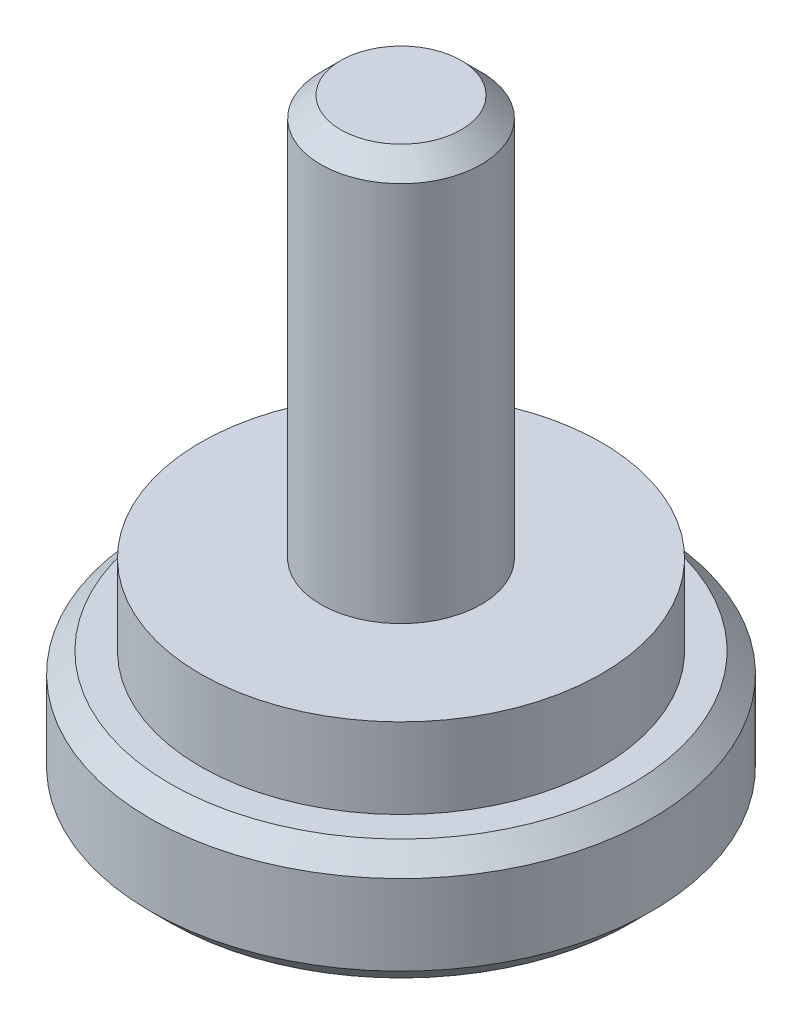
ISO-10303-21;
HEADER;
FILE_DESCRIPTION(('STEP AP214'),'2;1');
FILE_NAME('part.step','',(''),(''),'','','');
FILE_SCHEMA(('AUTOMOTIVE_DESIGN { 1 0 10303 214 1 1 1 1 }'));
ENDSEC;
DATA;
#1=APPLICATION_CONTEXT('core data for automotive mechanical design processes');
#2=APPLICATION_PROTOCOL_DEFINITION('international standard','automotive_design',2000,#1);
#3=PRODUCT_CONTEXT('',#1,'mechanical');
#4=PRODUCT('Part','Part','',(#3));
#5=PRODUCT_RELATED_PRODUCT_CATEGORY('part','',(#4));
#6=PRODUCT_DEFINITION_FORMATION('','',#4);
#7=PRODUCT_DEFINITION_CONTEXT('part definition',#1,'design');
#8=PRODUCT_DEFINITION('design','',#6,#7);
#9=PRODUCT_DEFINITION_SHAPE('','',#8);
#10=(LENGTH_UNIT() NAMED_UNIT(*) SI_UNIT(.MILLI.,.METRE.));
#11=(NAMED_UNIT(*) PLANE_ANGLE_UNIT() SI_UNIT($,.RADIAN.));
#12=(NAMED_UNIT(*) SI_UNIT($,.STERADIAN.) SOLID_ANGLE_UNIT());
#13=UNCERTAINTY_MEASURE_WITH_UNIT(LENGTH_MEASURE(1.E-05),#10,'distance_accuracy_value','');
#14=(GEOMETRIC_REPRESENTATION_CONTEXT(3) GLOBAL_UNCERTAINTY_ASSIGNED_CONTEXT((#13)) GLOBAL_UNIT_ASSIGNED_CONTEXT((#10,
#11,#12)) REPRESENTATION_CONTEXT('',''));
#15=CARTESIAN_POINT('',(0.,0.,0.));
#16=DIRECTION('',(0.,0.,1.));
#17=DIRECTION('',(1.,0.,0.));
#18=AXIS2_PLACEMENT_3D('',#15,#16,#17);
#19=CARTESIAN_POINT('',(0.,5.,0.));
#20=DIRECTION('',(0.,1.,0.));
#21=DIRECTION('',(0.,0.,1.));
#22=AXIS2_PLACEMENT_3D('',#19,#20,#21);
#23=PLANE('',#22);
#24=CARTESIAN_POINT('',(0.,5.,0.));
#25=DIRECTION('',(0.,1.,0.));
#26=DIRECTION('',(0.,0.,1.));
#27=AXIS2_PLACEMENT_3D('',#24,#25,#26);
#28=CIRCLE('',#27,5.);
#29=CARTESIAN_POINT('',(0.,5.,5.));
#30=VERTEX_POINT('',#29);
#31=EDGE_CURVE('E142',#30,#30,#28,.T.);
#32=ORIENTED_EDGE('',*,*,#31,.T.);
#33=EDGE_LOOP('',(#32));
#34=FACE_BOUND('',#33,.T.);
#35=CARTESIAN_POINT('',(0.,5.,0.));
#36=DIRECTION('',(0.,1.,0.));
#37=DIRECTION('',(0.,0.,1.));
#38=AXIS2_PLACEMENT_3D('',#35,#36,#37);
#39=CIRCLE('',#38,2.);
#40=CARTESIAN_POINT('',(0.,5.,2.));
#41=VERTEX_POINT('',#40);
#42=EDGE_CURVE('E133',#41,#41,#39,.T.);
#43=ORIENTED_EDGE('',*,*,#42,.F.);
#44=EDGE_LOOP('',(#43));
#45=FACE_BOUND('',#44,.T.);
#46=ADVANCED_FACE('F31',(#34,#45),#23,.T.);
#47=CARTESIAN_POINT('',(0.,3.,0.));
#48=DIRECTION('',(0.,1.,0.));
#49=DIRECTION('',(0.,0.,1.));
#50=AXIS2_PLACEMENT_3D('',#47,#48,#49);
#51=PLANE('',#50);
#52=CARTESIAN_POINT('',(0.,3.,0.));
#53=DIRECTION('',(0.,1.,0.));
#54=DIRECTION('',(0.,0.,1.));
#55=AXIS2_PLACEMENT_3D('',#52,#53,#54);
#56=CIRCLE('',#55,5.75);
#57=CARTESIAN_POINT('',(0.,3.,5.75));
#58=VERTEX_POINT('',#57);
#59=EDGE_CURVE('E145',#58,#58,#56,.T.);
#60=ORIENTED_EDGE('',*,*,#59,.T.);
#61=EDGE_LOOP('',(#60));
#62=FACE_BOUND('',#61,.T.);
#63=CARTESIAN_POINT('',(0.,3.,0.));
#64=DIRECTION('',(0.,1.,0.));
#65=DIRECTION('',(0.,0.,1.));
#66=AXIS2_PLACEMENT_3D('',#63,#64,#65);
#67=CIRCLE('',#66,5.);
#68=CARTESIAN_POINT('',(0.,3.,5.));
#69=VERTEX_POINT('',#68);
#70=EDGE_CURVE('E141',#69,#69,#67,.T.);
#71=ORIENTED_EDGE('',*,*,#70,.F.);
#72=EDGE_LOOP('',(#71));
#73=FACE_BOUND('',#72,.T.);
#74=ADVANCED_FACE('F177',(#62,#73),#51,.T.);
#75=CARTESIAN_POINT('',(0.,3.,0.));
#76=DIRECTION('',(0.,-1.,0.));
#77=DIRECTION('',(0.,0.,-1.));
#78=AXIS2_PLACEMENT_3D('',#75,#76,#77);
#79=CYLINDRICAL_SURFACE('',#78,6.25);
#80=CARTESIAN_POINT('',(0.,2.5,0.));
#81=DIRECTION('',(0.,1.,0.));
#82=DIRECTION('',(0.,0.,1.));
#83=AXIS2_PLACEMENT_3D('',#80,#81,#82);
#84=CIRCLE('',#83,6.25);
#85=CARTESIAN_POINT('',(0.,2.5,6.25));
#86=VERTEX_POINT('',#85);
#87=EDGE_CURVE('E153',#86,#86,#84,.F.);
#88=ORIENTED_EDGE('',*,*,#87,.T.);
#89=EDGE_LOOP('',(#88));
#90=FACE_BOUND('',#89,.T.);
#91=CARTESIAN_POINT('',(0.,0.499999999999997,0.));
#92=DIRECTION('',(0.,1.,0.));
#93=DIRECTION('',(0.,0.,1.));
#94=AXIS2_PLACEMENT_3D('',#91,#92,#93);
#95=CIRCLE('',#94,6.25);
#96=CARTESIAN_POINT('',(0.,0.499999999999997,6.25));
#97=VERTEX_POINT('',#96);
#98=EDGE_CURVE('E150',#97,#97,#95,.T.);
#99=ORIENTED_EDGE('',*,*,#98,.T.);
#100=EDGE_LOOP('',(#99));
#101=FACE_BOUND('',#100,.T.);
#102=ADVANCED_FACE('F183',(#90,#101),#79,.T.);
#103=CARTESIAN_POINT('',(0.,0.,0.));
#104=DIRECTION('',(0.,1.,0.));
#105=DIRECTION('',(0.,0.,1.));
#106=AXIS2_PLACEMENT_3D('',#103,#104,#105);
#107=PLANE('',#106);
#108=DIRECTION('',(-0.866025403784439,0.,-0.5));
#109=VECTOR('',#108,1.);
#110=CARTESIAN_POINT('',(0.,0.,2.3094010767585));
#111=LINE('',#110,#109);
#112=CARTESIAN_POINT('',(0.,0.,2.3094010767585));
#113=VERTEX_POINT('',#112);
#114=CARTESIAN_POINT('',(-2.,0.,1.15470053837925));
#115=VERTEX_POINT('',#114);
#116=EDGE_CURVE('E120',#113,#115,#111,.T.);
#117=ORIENTED_EDGE('',*,*,#116,.F.);
#118=DIRECTION('',(-0.866025403784439,0.,0.5));
#119=VECTOR('',#118,1.);
#120=CARTESIAN_POINT('',(2.,0.,1.15470053837925));
#121=LINE('',#120,#119);
#122=CARTESIAN_POINT('',(2.,0.,1.15470053837925));
#123=VERTEX_POINT('',#122);
#124=EDGE_CURVE('E46',#123,#113,#121,.T.);
#125=ORIENTED_EDGE('',*,*,#124,.F.);
#126=DIRECTION('',(0.,0.,1.));
#127=VECTOR('',#126,1.);
#128=CARTESIAN_POINT('',(2.,0.,-1.15470053837925));
#129=LINE('',#128,#127);
#130=CARTESIAN_POINT('',(2.,0.,-1.15470053837925));
#131=VERTEX_POINT('',#130);
#132=EDGE_CURVE('E129',#131,#123,#129,.T.);
#133=ORIENTED_EDGE('',*,*,#132,.F.);
#134=DIRECTION('',(0.866025403784439,0.,0.5));
#135=VECTOR('',#134,1.);
#136=CARTESIAN_POINT('',(0.,0.,-2.3094010767585));
#137=LINE('',#136,#135);
#138=CARTESIAN_POINT('',(0.,0.,-2.3094010767585));
#139=VERTEX_POINT('',#138);
#140=EDGE_CURVE('E127',#139,#131,#137,.T.);
#141=ORIENTED_EDGE('',*,*,#140,.F.);
#142=DIRECTION('',(0.866025403784439,0.,-0.5));
#143=VECTOR('',#142,1.);
#144=CARTESIAN_POINT('',(-2.,0.,-1.15470053837925));
#145=LINE('',#144,#143);
#146=CARTESIAN_POINT('',(-2.,0.,-1.15470053837925));
#147=VERTEX_POINT('',#146);
#148=EDGE_CURVE('E94',#147,#139,#145,.T.);
#149=ORIENTED_EDGE('',*,*,#148,.F.);
#150=DIRECTION('',(0.,0.,-1.));
#151=VECTOR('',#150,1.);
#152=CARTESIAN_POINT('',(-2.,0.,1.15470053837925));
#153=LINE('',#152,#151);
#154=EDGE_CURVE('E123',#115,#147,#153,.T.);
#155=ORIENTED_EDGE('',*,*,#154,.F.);
#156=EDGE_LOOP('',(#117,#125,#133,#141,#149,#155));
#157=FACE_BOUND('',#156,.T.);
#158=CARTESIAN_POINT('',(0.,0.,0.));
#159=DIRECTION('',(0.,1.,0.));
#160=DIRECTION('',(0.,0.,1.));
#161=AXIS2_PLACEMENT_3D('',#158,#159,#160);
#162=CIRCLE('',#161,5.75);
#163=CARTESIAN_POINT('',(0.,0.,5.75));
#164=VERTEX_POINT('',#163);
#165=EDGE_CURVE('E156',#164,#164,#162,.F.);
#166=ORIENTED_EDGE('',*,*,#165,.T.);
#167=EDGE_LOOP('',(#166));
#168=FACE_BOUND('',#167,.T.);
#169=ADVANCED_FACE('F193',(#157,#168),#107,.F.);
#170=CARTESIAN_POINT('',(0.,5.,0.));
#171=DIRECTION('',(0.,-1.,0.));
#172=DIRECTION('',(0.,0.,-1.));
#173=AXIS2_PLACEMENT_3D('',#170,#171,#172);
#174=CYLINDRICAL_SURFACE('',#173,5.);
#175=ORIENTED_EDGE('',*,*,#31,.F.);
#176=EDGE_LOOP('',(#175));
#177=FACE_BOUND('',#176,.T.);
#178=ORIENTED_EDGE('',*,*,#70,.T.);
#179=EDGE_LOOP('',(#178));
#180=FACE_BOUND('',#179,.T.);
#181=ADVANCED_FACE('F191',(#177,#180),#174,.T.);
#182=CARTESIAN_POINT('',(0.,15.,0.));
#183=DIRECTION('',(0.,-1.,0.));
#184=DIRECTION('',(0.,0.,-1.));
#185=AXIS2_PLACEMENT_3D('',#182,#183,#184);
#186=CYLINDRICAL_SURFACE('',#185,2.);
#187=CARTESIAN_POINT('',(0.,14.5,0.));
#188=DIRECTION('',(0.,1.,0.));
#189=DIRECTION('',(0.,0.,1.));
#190=AXIS2_PLACEMENT_3D('',#187,#188,#189);
#191=CIRCLE('',#190,2.);
#192=CARTESIAN_POINT('',(0.,14.5,2.));
#193=VERTEX_POINT('',#192);
#194=EDGE_CURVE('E11',#193,#193,#191,.F.);
#195=ORIENTED_EDGE('',*,*,#194,.T.);
#196=EDGE_LOOP('',(#195));
#197=FACE_BOUND('',#196,.T.);
#198=ORIENTED_EDGE('',*,*,#42,.T.);
#199=EDGE_LOOP('',(#198));
#200=FACE_BOUND('',#199,.T.);
#201=ADVANCED_FACE('F189',(#197,#200),#186,.T.);
#202=CARTESIAN_POINT('',(0.,15.,0.));
#203=DIRECTION('',(0.,1.,0.));
#204=DIRECTION('',(0.,0.,1.));
#205=AXIS2_PLACEMENT_3D('',#202,#203,#204);
#206=PLANE('',#205);
#207=CARTESIAN_POINT('',(0.,15.,0.));
#208=DIRECTION('',(0.,1.,0.));
#209=DIRECTION('',(0.,0.,1.));
#210=AXIS2_PLACEMENT_3D('',#207,#208,#209);
#211=CIRCLE('',#210,1.5);
#212=CARTESIAN_POINT('',(0.,15.,1.5));
#213=VERTEX_POINT('',#212);
#214=EDGE_CURVE('E39',#213,#213,#211,.T.);
#215=ORIENTED_EDGE('',*,*,#214,.T.);
#216=EDGE_LOOP('',(#215));
#217=FACE_BOUND('',#216,.T.);
#218=ADVANCED_FACE('F161',(#217),#206,.T.);
#219=CARTESIAN_POINT('',(0.,3.,0.));
#220=DIRECTION('',(0.,-1.,0.));
#221=DIRECTION('',(0.,0.,-1.));
#222=AXIS2_PLACEMENT_3D('',#219,#220,#221);
#223=CONICAL_SURFACE('',#222,5.75,0.785398163397445);
#224=ORIENTED_EDGE('',*,*,#87,.F.);
#225=EDGE_LOOP('',(#224));
#226=FACE_BOUND('',#225,.T.);
#227=ORIENTED_EDGE('',*,*,#59,.F.);
#228=EDGE_LOOP('',(#227));
#229=FACE_BOUND('',#228,.T.);
#230=ADVANCED_FACE('F173',(#226,#229),#223,.T.);
#231=CARTESIAN_POINT('',(0.,0.499999999999997,0.));
#232=DIRECTION('',(0.,1.,0.));
#233=DIRECTION('',(0.,0.,1.));
#234=AXIS2_PLACEMENT_3D('',#231,#232,#233);
#235=CONICAL_SURFACE('',#234,6.25,0.785398163397454);
#236=ORIENTED_EDGE('',*,*,#165,.F.);
#237=EDGE_LOOP('',(#236));
#238=FACE_BOUND('',#237,.T.);
#239=ORIENTED_EDGE('',*,*,#98,.F.);
#240=EDGE_LOOP('',(#239));
#241=FACE_BOUND('',#240,.T.);
#242=ADVANCED_FACE('F165',(#238,#241),#235,.T.);
#243=CARTESIAN_POINT('',(0.,15.,0.));
#244=DIRECTION('',(0.,-1.,0.));
#245=DIRECTION('',(0.,0.,-1.));
#246=AXIS2_PLACEMENT_3D('',#243,#244,#245);
#247=CONICAL_SURFACE('',#246,1.5,0.785398163397445);
#248=ORIENTED_EDGE('',*,*,#194,.F.);
#249=EDGE_LOOP('',(#248));
#250=FACE_BOUND('',#249,.T.);
#251=ORIENTED_EDGE('',*,*,#214,.F.);
#252=EDGE_LOOP('',(#251));
#253=FACE_BOUND('',#252,.T.);
#254=ADVANCED_FACE('F33',(#250,#253),#247,.T.);
#255=CARTESIAN_POINT('',(2.,4.,1.15470053837925));
#256=DIRECTION('',(0.5,0.,0.866025403784439));
#257=DIRECTION('',(0.866025403784439,0.,-0.5));
#258=AXIS2_PLACEMENT_3D('',#255,#256,#257);
#259=PLANE('',#258);
#260=ORIENTED_EDGE('',*,*,#124,.T.);
#261=DIRECTION('',(0.,-1.,0.));
#262=VECTOR('',#261,1.);
#263=CARTESIAN_POINT('',(0.,4.,2.3094010767585));
#264=LINE('',#263,#262);
#265=CARTESIAN_POINT('',(0.,4.,2.3094010767585));
#266=VERTEX_POINT('',#265);
#267=EDGE_CURVE('E76',#266,#113,#264,.T.);
#268=ORIENTED_EDGE('',*,*,#267,.F.);
#269=DIRECTION('',(-0.866025403784439,0.,0.5));
#270=VECTOR('',#269,1.);
#271=CARTESIAN_POINT('',(2.,4.,1.15470053837925));
#272=LINE('',#271,#270);
#273=CARTESIAN_POINT('',(2.,4.,1.15470053837925));
#274=VERTEX_POINT('',#273);
#275=EDGE_CURVE('E131',#274,#266,#272,.T.);
#276=ORIENTED_EDGE('',*,*,#275,.F.);
#277=DIRECTION('',(0.,-1.,0.));
#278=VECTOR('',#277,1.);
#279=CARTESIAN_POINT('',(2.,4.,1.15470053837925));
#280=LINE('',#279,#278);
#281=EDGE_CURVE('E54',#274,#123,#280,.T.);
#282=ORIENTED_EDGE('',*,*,#281,.T.);
#283=EDGE_LOOP('',(#260,#268,#276,#282));
#284=FACE_BOUND('',#283,.T.);
#285=ADVANCED_FACE('F164',(#284),#259,.F.);
#286=CARTESIAN_POINT('',(2.,4.,-1.15470053837925));
#287=DIRECTION('',(1.,0.,0.));
#288=DIRECTION('',(0.,0.,-1.));
#289=AXIS2_PLACEMENT_3D('',#286,#287,#288);
#290=PLANE('',#289);
#291=ORIENTED_EDGE('',*,*,#132,.T.);
#292=ORIENTED_EDGE('',*,*,#281,.F.);
#293=DIRECTION('',(0.,0.,1.));
#294=VECTOR('',#293,1.);
#295=CARTESIAN_POINT('',(2.,4.,-1.15470053837925));
#296=LINE('',#295,#294);
#297=CARTESIAN_POINT('',(2.,4.,-1.15470053837925));
#298=VERTEX_POINT('',#297);
#299=EDGE_CURVE('E106',#298,#274,#296,.T.);
#300=ORIENTED_EDGE('',*,*,#299,.F.);
#301=DIRECTION('',(0.,-1.,0.));
#302=VECTOR('',#301,1.);
#303=CARTESIAN_POINT('',(2.,4.,-1.15470053837925));
#304=LINE('',#303,#302);
#305=EDGE_CURVE('E98',#298,#131,#304,.T.);
#306=ORIENTED_EDGE('',*,*,#305,.T.);
#307=EDGE_LOOP('',(#291,#292,#300,#306));
#308=FACE_BOUND('',#307,.T.);
#309=ADVANCED_FACE('F171',(#308),#290,.F.);
#310=CARTESIAN_POINT('',(0.,4.,-2.3094010767585));
#311=DIRECTION('',(0.5,0.,-0.866025403784439));
#312=DIRECTION('',(-0.866025403784439,0.,-0.5));
#313=AXIS2_PLACEMENT_3D('',#310,#311,#312);
#314=PLANE('',#313);
#315=ORIENTED_EDGE('',*,*,#140,.T.);
#316=ORIENTED_EDGE('',*,*,#305,.F.);
#317=DIRECTION('',(0.866025403784439,0.,0.5));
#318=VECTOR('',#317,1.);
#319=CARTESIAN_POINT('',(0.,4.,-2.3094010767585));
#320=LINE('',#319,#318);
#321=CARTESIAN_POINT('',(0.,4.,-2.3094010767585));
#322=VERTEX_POINT('',#321);
#323=EDGE_CURVE('E102',#322,#298,#320,.T.);
#324=ORIENTED_EDGE('',*,*,#323,.F.);
#325=DIRECTION('',(0.,-1.,0.));
#326=VECTOR('',#325,1.);
#327=CARTESIAN_POINT('',(0.,4.,-2.3094010767585));
#328=LINE('',#327,#326);
#329=EDGE_CURVE('E87',#322,#139,#328,.T.);
#330=ORIENTED_EDGE('',*,*,#329,.T.);
#331=EDGE_LOOP('',(#315,#316,#324,#330));
#332=FACE_BOUND('',#331,.T.);
#333=ADVANCED_FACE('F103',(#332),#314,.F.);
#334=CARTESIAN_POINT('',(-2.,4.,-1.15470053837925));
#335=DIRECTION('',(-0.5,0.,-0.866025403784439));
#336=DIRECTION('',(-0.866025403784439,0.,0.5));
#337=AXIS2_PLACEMENT_3D('',#334,#335,#336);
#338=PLANE('',#337);
#339=ORIENTED_EDGE('',*,*,#148,.T.);
#340=ORIENTED_EDGE('',*,*,#329,.F.);
#341=DIRECTION('',(0.866025403784439,0.,-0.5));
#342=VECTOR('',#341,1.);
#343=CARTESIAN_POINT('',(-2.,4.,-1.15470053837925));
#344=LINE('',#343,#342);
#345=CARTESIAN_POINT('',(-2.,4.,-1.15470053837925));
#346=VERTEX_POINT('',#345);
#347=EDGE_CURVE('E91',#346,#322,#344,.T.);
#348=ORIENTED_EDGE('',*,*,#347,.F.);
#349=DIRECTION('',(0.,-1.,0.));
#350=VECTOR('',#349,1.);
#351=CARTESIAN_POINT('',(-2.,4.,-1.15470053837925));
#352=LINE('',#351,#350);
#353=EDGE_CURVE('E99',#346,#147,#352,.T.);
#354=ORIENTED_EDGE('',*,*,#353,.T.);
#355=EDGE_LOOP('',(#339,#340,#348,#354));
#356=FACE_BOUND('',#355,.T.);
#357=ADVANCED_FACE('F89',(#356),#338,.F.);
#358=CARTESIAN_POINT('',(-2.,4.,1.15470053837925));
#359=DIRECTION('',(-1.,0.,0.));
#360=DIRECTION('',(0.,0.,1.));
#361=AXIS2_PLACEMENT_3D('',#358,#359,#360);
#362=PLANE('',#361);
#363=ORIENTED_EDGE('',*,*,#154,.T.);
#364=ORIENTED_EDGE('',*,*,#353,.F.);
#365=DIRECTION('',(0.,0.,-1.));
#366=VECTOR('',#365,1.);
#367=CARTESIAN_POINT('',(-2.,4.,1.15470053837925));
#368=LINE('',#367,#366);
#369=CARTESIAN_POINT('',(-2.,4.,1.15470053837925));
#370=VERTEX_POINT('',#369);
#371=EDGE_CURVE('E112',#370,#346,#368,.T.);
#372=ORIENTED_EDGE('',*,*,#371,.F.);
#373=DIRECTION('',(0.,-1.,0.));
#374=VECTOR('',#373,1.);
#375=CARTESIAN_POINT('',(-2.,4.,1.15470053837925));
#376=LINE('',#375,#374);
#377=EDGE_CURVE('E136',#370,#115,#376,.T.);
#378=ORIENTED_EDGE('',*,*,#377,.T.);
#379=EDGE_LOOP('',(#363,#364,#372,#378));
#380=FACE_BOUND('',#379,.T.);
#381=ADVANCED_FACE('F224',(#380),#362,.F.);
#382=CARTESIAN_POINT('',(0.,4.,2.3094010767585));
#383=DIRECTION('',(-0.5,0.,0.866025403784439));
#384=DIRECTION('',(0.866025403784439,0.,0.5));
#385=AXIS2_PLACEMENT_3D('',#382,#383,#384);
#386=PLANE('',#385);
#387=ORIENTED_EDGE('',*,*,#116,.T.);
#388=ORIENTED_EDGE('',*,*,#377,.F.);
#389=DIRECTION('',(-0.866025403784439,0.,-0.5));
#390=VECTOR('',#389,1.);
#391=CARTESIAN_POINT('',(0.,4.,2.3094010767585));
#392=LINE('',#391,#390);
#393=EDGE_CURVE('E114',#266,#370,#392,.T.);
#394=ORIENTED_EDGE('',*,*,#393,.F.);
#395=ORIENTED_EDGE('',*,*,#267,.T.);
#396=EDGE_LOOP('',(#387,#388,#394,#395));
#397=FACE_BOUND('',#396,.T.);
#398=ADVANCED_FACE('F221',(#397),#386,.F.);
#399=CARTESIAN_POINT('',(0.,4.,2.3094010767585));
#400=DIRECTION('',(0.,-1.,0.));
#401=DIRECTION('',(0.,0.,-1.));
#402=AXIS2_PLACEMENT_3D('',#399,#400,#401);
#403=PLANE('',#402);
#404=ORIENTED_EDGE('',*,*,#275,.T.);
#405=ORIENTED_EDGE('',*,*,#393,.T.);
#406=ORIENTED_EDGE('',*,*,#371,.T.);
#407=ORIENTED_EDGE('',*,*,#347,.T.);
#408=ORIENTED_EDGE('',*,*,#323,.T.);
#409=ORIENTED_EDGE('',*,*,#299,.T.);
#410=EDGE_LOOP('',(#404,#405,#406,#407,#408,#409));
#411=FACE_BOUND('',#410,.T.);
#412=ADVANCED_FACE('F109',(#411),#403,.T.);
#413=CLOSED_SHELL('',(#46,#74,#102,#169,#181,#201,#218,#230,#242,#254,#285,#309,#333,#357,#381,
#398,#412));
#414=MANIFOLD_SOLID_BREP('B2',#413);
#415=ADVANCED_BREP_SHAPE_REPRESENTATION('',(#18,#414),#14);
#416=SHAPE_DEFINITION_REPRESENTATION(#9,#415);
ENDSEC;
END-ISO-10303-21;
